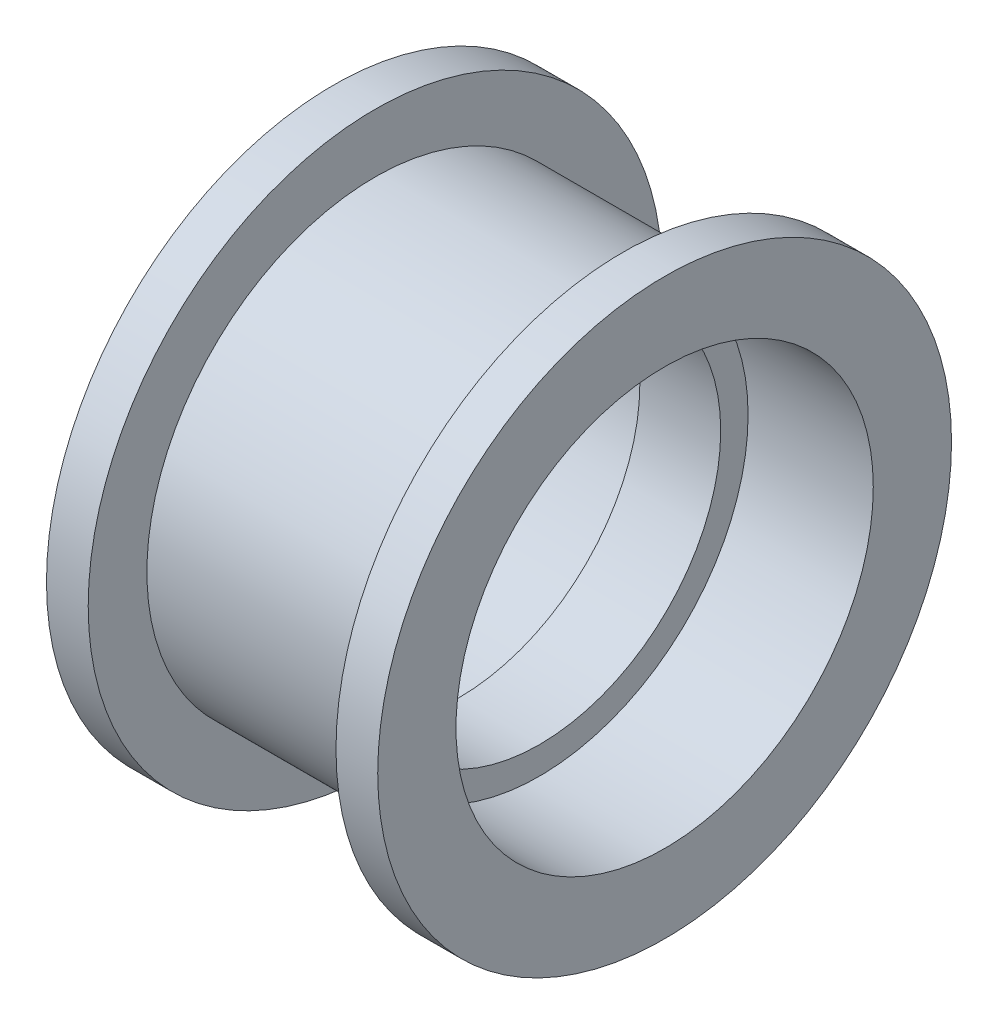
ISO-10303-21;
HEADER;
FILE_DESCRIPTION(('STEP AP214'),'2;1');
FILE_NAME('part.step','',(''),(''),'','','');
FILE_SCHEMA(('AUTOMOTIVE_DESIGN { 1 0 10303 214 1 1 1 1 }'));
ENDSEC;
DATA;
#1=APPLICATION_CONTEXT('core data for automotive mechanical design processes');
#2=APPLICATION_PROTOCOL_DEFINITION('international standard','automotive_design',2000,#1);
#3=PRODUCT_CONTEXT('',#1,'mechanical');
#4=PRODUCT('Part','Part','',(#3));
#5=PRODUCT_RELATED_PRODUCT_CATEGORY('part','',(#4));
#6=PRODUCT_DEFINITION_FORMATION('','',#4);
#7=PRODUCT_DEFINITION_CONTEXT('part definition',#1,'design');
#8=PRODUCT_DEFINITION('design','',#6,#7);
#9=PRODUCT_DEFINITION_SHAPE('','',#8);
#10=(LENGTH_UNIT() NAMED_UNIT(*) SI_UNIT(.MILLI.,.METRE.));
#11=(NAMED_UNIT(*) PLANE_ANGLE_UNIT() SI_UNIT($,.RADIAN.));
#12=(NAMED_UNIT(*) SI_UNIT($,.STERADIAN.) SOLID_ANGLE_UNIT());
#13=UNCERTAINTY_MEASURE_WITH_UNIT(LENGTH_MEASURE(1.E-05),#10,'distance_accuracy_value','');
#14=(GEOMETRIC_REPRESENTATION_CONTEXT(3) GLOBAL_UNCERTAINTY_ASSIGNED_CONTEXT((#13)) GLOBAL_UNIT_ASSIGNED_CONTEXT((#10,
#11,#12)) REPRESENTATION_CONTEXT('',''));
#15=CARTESIAN_POINT('',(0.,0.,0.));
#16=DIRECTION('',(0.,0.,1.));
#17=DIRECTION('',(1.,0.,0.));
#18=AXIS2_PLACEMENT_3D('',#15,#16,#17);
#19=CARTESIAN_POINT('',(-1.55,6.9499999999999,0.));
#20=DIRECTION('',(-1.,0.,0.));
#21=DIRECTION('',(0.,0.,1.));
#22=AXIS2_PLACEMENT_3D('',#19,#20,#21);
#23=PLANE('',#22);
#24=CARTESIAN_POINT('',(-1.55,0.,0.));
#25=DIRECTION('',(1.,0.,0.));
#26=DIRECTION('',(0.,0.,-1.));
#27=AXIS2_PLACEMENT_3D('',#24,#25,#26);
#28=CIRCLE('',#27,6.95);
#29=CARTESIAN_POINT('',(-1.55,0.,-6.95));
#30=VERTEX_POINT('',#29);
#31=EDGE_CURVE('E12',#30,#30,#28,.T.);
#32=ORIENTED_EDGE('',*,*,#31,.T.);
#33=EDGE_LOOP('',(#32));
#34=FACE_BOUND('',#33,.T.);
#35=CARTESIAN_POINT('',(-1.55,0.,0.));
#36=DIRECTION('',(1.,0.,0.));
#37=DIRECTION('',(0.,0.,-1.));
#38=AXIS2_PLACEMENT_3D('',#35,#36,#37);
#39=CIRCLE('',#38,8.);
#40=CARTESIAN_POINT('',(-1.55,0.,-8.));
#41=VERTEX_POINT('',#40);
#42=EDGE_CURVE('E78',#41,#41,#39,.T.);
#43=ORIENTED_EDGE('',*,*,#42,.F.);
#44=EDGE_LOOP('',(#43));
#45=FACE_BOUND('',#44,.T.);
#46=ADVANCED_FACE('F38',(#34,#45),#23,.T.);
#47=CARTESIAN_POINT('',(0.,0.,0.));
#48=DIRECTION('',(1.,0.,0.));
#49=DIRECTION('',(0.,0.,-1.));
#50=AXIS2_PLACEMENT_3D('',#47,#48,#49);
#51=CYLINDRICAL_SURFACE('',#50,6.95);
#52=CARTESIAN_POINT('',(1.55,0.,0.));
#53=DIRECTION('',(1.,0.,0.));
#54=DIRECTION('',(0.,0.,-1.));
#55=AXIS2_PLACEMENT_3D('',#52,#53,#54);
#56=CIRCLE('',#55,6.95);
#57=CARTESIAN_POINT('',(1.55,0.,-6.95));
#58=VERTEX_POINT('',#57);
#59=EDGE_CURVE('E44',#58,#58,#56,.T.);
#60=ORIENTED_EDGE('',*,*,#59,.T.);
#61=EDGE_LOOP('',(#60));
#62=FACE_BOUND('',#61,.T.);
#63=ORIENTED_EDGE('',*,*,#31,.F.);
#64=EDGE_LOOP('',(#63));
#65=FACE_BOUND('',#64,.T.);
#66=ADVANCED_FACE('F86',(#62,#65),#51,.F.);
#67=CARTESIAN_POINT('',(1.55,6.9499999999999,0.));
#68=DIRECTION('',(1.,0.,0.));
#69=DIRECTION('',(0.,0.,-1.));
#70=AXIS2_PLACEMENT_3D('',#67,#68,#69);
#71=PLANE('',#70);
#72=CARTESIAN_POINT('',(1.55,0.,0.));
#73=DIRECTION('',(1.,0.,0.));
#74=DIRECTION('',(0.,0.,-1.));
#75=AXIS2_PLACEMENT_3D('',#72,#73,#74);
#76=CIRCLE('',#75,8.);
#77=CARTESIAN_POINT('',(1.55,0.,-8.));
#78=VERTEX_POINT('',#77);
#79=EDGE_CURVE('E48',#78,#78,#76,.T.);
#80=ORIENTED_EDGE('',*,*,#79,.T.);
#81=EDGE_LOOP('',(#80));
#82=FACE_BOUND('',#81,.T.);
#83=ORIENTED_EDGE('',*,*,#59,.F.);
#84=EDGE_LOOP('',(#83));
#85=FACE_BOUND('',#84,.T.);
#86=ADVANCED_FACE('F90',(#82,#85),#71,.T.);
#87=CARTESIAN_POINT('',(0.,0.,0.));
#88=DIRECTION('',(1.,0.,0.));
#89=DIRECTION('',(0.,0.,-1.));
#90=AXIS2_PLACEMENT_3D('',#87,#88,#89);
#91=CYLINDRICAL_SURFACE('',#90,8.);
#92=CARTESIAN_POINT('',(6.35000000000002,0.,0.));
#93=DIRECTION('',(1.,0.,0.));
#94=DIRECTION('',(0.,0.,-1.));
#95=AXIS2_PLACEMENT_3D('',#92,#93,#94);
#96=CIRCLE('',#95,8.);
#97=CARTESIAN_POINT('',(6.35000000000002,0.,-8.00000000000001));
#98=VERTEX_POINT('',#97);
#99=EDGE_CURVE('E52',#98,#98,#96,.T.);
#100=ORIENTED_EDGE('',*,*,#99,.T.);
#101=EDGE_LOOP('',(#100));
#102=FACE_BOUND('',#101,.T.);
#103=ORIENTED_EDGE('',*,*,#79,.F.);
#104=EDGE_LOOP('',(#103));
#105=FACE_BOUND('',#104,.T.);
#106=ADVANCED_FACE('F94',(#102,#105),#91,.F.);
#107=CARTESIAN_POINT('',(6.35000000000002,7.9999999999999,0.));
#108=DIRECTION('',(1.,0.,0.));
#109=DIRECTION('',(0.,0.,-1.));
#110=AXIS2_PLACEMENT_3D('',#107,#108,#109);
#111=PLANE('',#110);
#112=CARTESIAN_POINT('',(6.35000000000002,0.,0.));
#113=DIRECTION('',(1.,0.,0.));
#114=DIRECTION('',(0.,0.,-1.));
#115=AXIS2_PLACEMENT_3D('',#112,#113,#114);
#116=CIRCLE('',#115,11.);
#117=CARTESIAN_POINT('',(6.35000000000002,0.,-11.));
#118=VERTEX_POINT('',#117);
#119=EDGE_CURVE('E57',#118,#118,#116,.T.);
#120=ORIENTED_EDGE('',*,*,#119,.T.);
#121=EDGE_LOOP('',(#120));
#122=FACE_BOUND('',#121,.T.);
#123=ORIENTED_EDGE('',*,*,#99,.F.);
#124=EDGE_LOOP('',(#123));
#125=FACE_BOUND('',#124,.T.);
#126=ADVANCED_FACE('F101',(#122,#125),#111,.T.);
#127=CARTESIAN_POINT('',(0.,0.,0.));
#128=DIRECTION('',(1.,0.,0.));
#129=DIRECTION('',(0.,0.,-1.));
#130=AXIS2_PLACEMENT_3D('',#127,#128,#129);
#131=CYLINDRICAL_SURFACE('',#130,11.);
#132=CARTESIAN_POINT('',(4.75000000000003,0.,0.));
#133=DIRECTION('',(1.,0.,0.));
#134=DIRECTION('',(0.,0.,-1.));
#135=AXIS2_PLACEMENT_3D('',#132,#133,#134);
#136=CIRCLE('',#135,11.);
#137=CARTESIAN_POINT('',(4.75000000000003,0.,-11.));
#138=VERTEX_POINT('',#137);
#139=EDGE_CURVE('E60',#138,#138,#136,.T.);
#140=ORIENTED_EDGE('',*,*,#139,.T.);
#141=EDGE_LOOP('',(#140));
#142=FACE_BOUND('',#141,.T.);
#143=ORIENTED_EDGE('',*,*,#119,.F.);
#144=EDGE_LOOP('',(#143));
#145=FACE_BOUND('',#144,.T.);
#146=ADVANCED_FACE('F105',(#142,#145),#131,.T.);
#147=CARTESIAN_POINT('',(4.75000000000003,10.9999999999999,0.));
#148=DIRECTION('',(-1.,0.,0.));
#149=DIRECTION('',(0.,0.,1.));
#150=AXIS2_PLACEMENT_3D('',#147,#148,#149);
#151=PLANE('',#150);
#152=CARTESIAN_POINT('',(4.75000000000003,0.,0.));
#153=DIRECTION('',(1.,0.,0.));
#154=DIRECTION('',(0.,0.,-1.));
#155=AXIS2_PLACEMENT_3D('',#152,#153,#154);
#156=CIRCLE('',#155,8.75);
#157=CARTESIAN_POINT('',(4.75000000000003,0.,-8.75000000000001));
#158=VERTEX_POINT('',#157);
#159=EDGE_CURVE('E63',#158,#158,#156,.T.);
#160=ORIENTED_EDGE('',*,*,#159,.T.);
#161=EDGE_LOOP('',(#160));
#162=FACE_BOUND('',#161,.T.);
#163=ORIENTED_EDGE('',*,*,#139,.F.);
#164=EDGE_LOOP('',(#163));
#165=FACE_BOUND('',#164,.T.);
#166=ADVANCED_FACE('F109',(#162,#165),#151,.T.);
#167=CARTESIAN_POINT('',(0.,0.,0.));
#168=DIRECTION('',(1.,0.,0.));
#169=DIRECTION('',(0.,0.,-1.));
#170=AXIS2_PLACEMENT_3D('',#167,#168,#169);
#171=CYLINDRICAL_SURFACE('',#170,8.75);
#172=CARTESIAN_POINT('',(-4.75000000000003,0.,0.));
#173=DIRECTION('',(1.,0.,0.));
#174=DIRECTION('',(0.,0.,-1.));
#175=AXIS2_PLACEMENT_3D('',#172,#173,#174);
#176=CIRCLE('',#175,8.75);
#177=CARTESIAN_POINT('',(-4.75000000000003,0.,-8.75));
#178=VERTEX_POINT('',#177);
#179=EDGE_CURVE('E66',#178,#178,#176,.T.);
#180=ORIENTED_EDGE('',*,*,#179,.T.);
#181=EDGE_LOOP('',(#180));
#182=FACE_BOUND('',#181,.T.);
#183=ORIENTED_EDGE('',*,*,#159,.F.);
#184=EDGE_LOOP('',(#183));
#185=FACE_BOUND('',#184,.T.);
#186=ADVANCED_FACE('F113',(#182,#185),#171,.T.);
#187=CARTESIAN_POINT('',(-4.75000000000003,10.9999999999999,0.));
#188=DIRECTION('',(1.,0.,0.));
#189=DIRECTION('',(0.,0.,-1.));
#190=AXIS2_PLACEMENT_3D('',#187,#188,#189);
#191=PLANE('',#190);
#192=CARTESIAN_POINT('',(-4.75000000000003,0.,0.));
#193=DIRECTION('',(1.,0.,0.));
#194=DIRECTION('',(0.,0.,-1.));
#195=AXIS2_PLACEMENT_3D('',#192,#193,#194);
#196=CIRCLE('',#195,11.);
#197=CARTESIAN_POINT('',(-4.75000000000003,0.,-11.));
#198=VERTEX_POINT('',#197);
#199=EDGE_CURVE('E69',#198,#198,#196,.T.);
#200=ORIENTED_EDGE('',*,*,#199,.T.);
#201=EDGE_LOOP('',(#200));
#202=FACE_BOUND('',#201,.T.);
#203=ORIENTED_EDGE('',*,*,#179,.F.);
#204=EDGE_LOOP('',(#203));
#205=FACE_BOUND('',#204,.T.);
#206=ADVANCED_FACE('F117',(#202,#205),#191,.T.);
#207=CARTESIAN_POINT('',(0.,0.,0.));
#208=DIRECTION('',(1.,0.,0.));
#209=DIRECTION('',(0.,0.,-1.));
#210=AXIS2_PLACEMENT_3D('',#207,#208,#209);
#211=CYLINDRICAL_SURFACE('',#210,11.);
#212=CARTESIAN_POINT('',(-6.35000000000002,0.,0.));
#213=DIRECTION('',(1.,0.,0.));
#214=DIRECTION('',(0.,0.,-1.));
#215=AXIS2_PLACEMENT_3D('',#212,#213,#214);
#216=CIRCLE('',#215,11.);
#217=CARTESIAN_POINT('',(-6.35000000000002,0.,-11.));
#218=VERTEX_POINT('',#217);
#219=EDGE_CURVE('E72',#218,#218,#216,.T.);
#220=ORIENTED_EDGE('',*,*,#219,.T.);
#221=EDGE_LOOP('',(#220));
#222=FACE_BOUND('',#221,.T.);
#223=ORIENTED_EDGE('',*,*,#199,.F.);
#224=EDGE_LOOP('',(#223));
#225=FACE_BOUND('',#224,.T.);
#226=ADVANCED_FACE('F121',(#222,#225),#211,.T.);
#227=CARTESIAN_POINT('',(-6.35000000000002,7.9999999999999,0.));
#228=DIRECTION('',(-1.,0.,0.));
#229=DIRECTION('',(0.,0.,1.));
#230=AXIS2_PLACEMENT_3D('',#227,#228,#229);
#231=PLANE('',#230);
#232=CARTESIAN_POINT('',(-6.35000000000002,0.,0.));
#233=DIRECTION('',(1.,0.,0.));
#234=DIRECTION('',(0.,0.,-1.));
#235=AXIS2_PLACEMENT_3D('',#232,#233,#234);
#236=CIRCLE('',#235,8.);
#237=CARTESIAN_POINT('',(-6.35000000000002,0.,-8.));
#238=VERTEX_POINT('',#237);
#239=EDGE_CURVE('E75',#238,#238,#236,.T.);
#240=ORIENTED_EDGE('',*,*,#239,.T.);
#241=EDGE_LOOP('',(#240));
#242=FACE_BOUND('',#241,.T.);
#243=ORIENTED_EDGE('',*,*,#219,.F.);
#244=EDGE_LOOP('',(#243));
#245=FACE_BOUND('',#244,.T.);
#246=ADVANCED_FACE('F125',(#242,#245),#231,.T.);
#247=CARTESIAN_POINT('',(0.,0.,0.));
#248=DIRECTION('',(1.,0.,0.));
#249=DIRECTION('',(0.,0.,-1.));
#250=AXIS2_PLACEMENT_3D('',#247,#248,#249);
#251=CYLINDRICAL_SURFACE('',#250,8.);
#252=ORIENTED_EDGE('',*,*,#42,.T.);
#253=EDGE_LOOP('',(#252));
#254=FACE_BOUND('',#253,.T.);
#255=ORIENTED_EDGE('',*,*,#239,.F.);
#256=EDGE_LOOP('',(#255));
#257=FACE_BOUND('',#256,.T.);
#258=ADVANCED_FACE('F82',(#254,#257),#251,.F.);
#259=CLOSED_SHELL('',(#46,#66,#86,#106,#126,#146,#166,#186,#206,#226,#246,#258));
#260=MANIFOLD_SOLID_BREP('B2',#259);
#261=ADVANCED_BREP_SHAPE_REPRESENTATION('',(#18,#260),#14);
#262=SHAPE_DEFINITION_REPRESENTATION(#9,#261);
ENDSEC;
END-ISO-10303-21;
